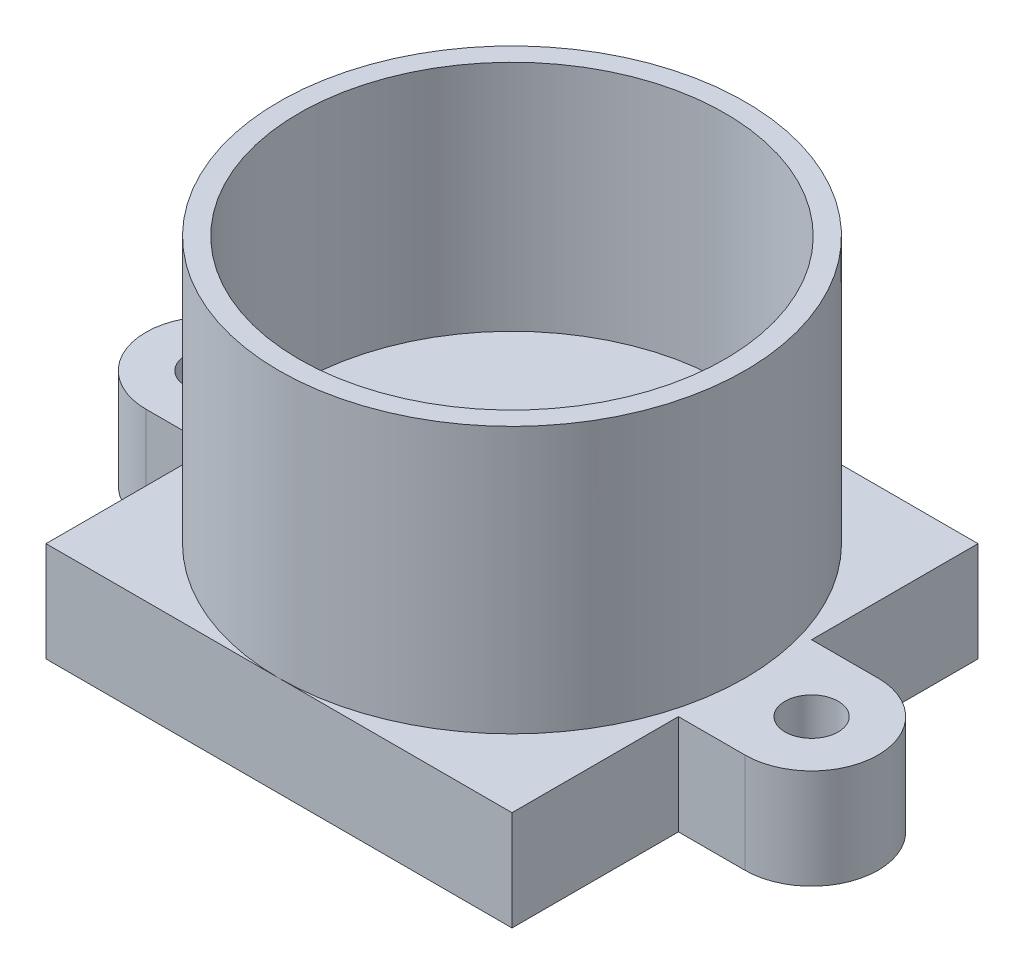
ISO-10303-21;
HEADER;
FILE_DESCRIPTION(('STEP AP214'),'2;1');
FILE_NAME('part.step','',(''),(''),'','','');
FILE_SCHEMA(('AUTOMOTIVE_DESIGN { 1 0 10303 214 1 1 1 1 }'));
ENDSEC;
DATA;
#1=APPLICATION_CONTEXT('core data for automotive mechanical design processes');
#2=APPLICATION_PROTOCOL_DEFINITION('international standard','automotive_design',2000,#1);
#3=PRODUCT_CONTEXT('',#1,'mechanical');
#4=PRODUCT('Part','Part','',(#3));
#5=PRODUCT_RELATED_PRODUCT_CATEGORY('part','',(#4));
#6=PRODUCT_DEFINITION_FORMATION('','',#4);
#7=PRODUCT_DEFINITION_CONTEXT('part definition',#1,'design');
#8=PRODUCT_DEFINITION('design','',#6,#7);
#9=PRODUCT_DEFINITION_SHAPE('','',#8);
#10=(LENGTH_UNIT() NAMED_UNIT(*) SI_UNIT(.MILLI.,.METRE.));
#11=(NAMED_UNIT(*) PLANE_ANGLE_UNIT() SI_UNIT($,.RADIAN.));
#12=(NAMED_UNIT(*) SI_UNIT($,.STERADIAN.) SOLID_ANGLE_UNIT());
#13=UNCERTAINTY_MEASURE_WITH_UNIT(LENGTH_MEASURE(1.E-05),#10,'distance_accuracy_value','');
#14=(GEOMETRIC_REPRESENTATION_CONTEXT(3) GLOBAL_UNCERTAINTY_ASSIGNED_CONTEXT((#13)) GLOBAL_UNIT_ASSIGNED_CONTEXT((#10,
#11,#12)) REPRESENTATION_CONTEXT('',''));
#15=CARTESIAN_POINT('',(0.,0.,0.));
#16=DIRECTION('',(0.,0.,1.));
#17=DIRECTION('',(1.,0.,0.));
#18=AXIS2_PLACEMENT_3D('',#15,#16,#17);
#19=CARTESIAN_POINT('',(0.,3.,0.));
#20=DIRECTION('',(0.,1.,0.));
#21=DIRECTION('',(0.,0.,1.));
#22=AXIS2_PLACEMENT_3D('',#19,#20,#21);
#23=PLANE('',#22);
#24=CARTESIAN_POINT('',(0.,3.,0.));
#25=DIRECTION('',(0.,1.,0.));
#26=DIRECTION('',(0.,0.,1.));
#27=AXIS2_PLACEMENT_3D('',#24,#25,#26);
#28=CIRCLE('',#27,7.);
#29=CARTESIAN_POINT('',(0.,3.,7.));
#30=VERTEX_POINT('',#29);
#31=CARTESIAN_POINT('',(0.,3.,-7.));
#32=VERTEX_POINT('',#31);
#33=EDGE_CURVE('E50',#30,#32,#28,.T.);
#34=ORIENTED_EDGE('',*,*,#33,.F.);
#35=DIRECTION('',(1.,0.,0.));
#36=VECTOR('',#35,1.);
#37=CARTESIAN_POINT('',(-6.99999999999999,3.,7.));
#38=LINE('',#37,#36);
#39=CARTESIAN_POINT('',(7.00000000000001,3.,7.));
#40=VERTEX_POINT('',#39);
#41=EDGE_CURVE('E146',#30,#40,#38,.T.);
#42=ORIENTED_EDGE('',*,*,#41,.T.);
#43=DIRECTION('',(0.,0.,-1.));
#44=VECTOR('',#43,1.);
#45=CARTESIAN_POINT('',(7.00000000000001,3.,-7.));
#46=LINE('',#45,#44);
#47=CARTESIAN_POINT('',(7.00000000000001,3.,2.));
#48=VERTEX_POINT('',#47);
#49=EDGE_CURVE('E272',#40,#48,#46,.T.);
#50=ORIENTED_EDGE('',*,*,#49,.T.);
#51=DIRECTION('',(1.,0.,0.));
#52=VECTOR('',#51,1.);
#53=CARTESIAN_POINT('',(7.00000000000001,3.,2.));
#54=LINE('',#53,#52);
#55=CARTESIAN_POINT('',(9.00000000000001,3.,2.));
#56=VERTEX_POINT('',#55);
#57=EDGE_CURVE('E63',#48,#56,#54,.T.);
#58=ORIENTED_EDGE('',*,*,#57,.T.);
#59=CARTESIAN_POINT('',(9.00000000000001,3.,0.));
#60=DIRECTION('',(0.,1.,0.));
#61=DIRECTION('',(0.,0.,-1.));
#62=AXIS2_PLACEMENT_3D('',#59,#60,#61);
#63=CIRCLE('',#62,2.);
#64=CARTESIAN_POINT('',(9.00000000000001,3.,-2.));
#65=VERTEX_POINT('',#64);
#66=EDGE_CURVE('E330',#56,#65,#63,.T.);
#67=ORIENTED_EDGE('',*,*,#66,.T.);
#68=DIRECTION('',(-1.,0.,0.));
#69=VECTOR('',#68,1.);
#70=CARTESIAN_POINT('',(7.00000000000001,3.,-2.));
#71=LINE('',#70,#69);
#72=CARTESIAN_POINT('',(7.00000000000001,3.,-2.));
#73=VERTEX_POINT('',#72);
#74=EDGE_CURVE('E312',#65,#73,#71,.T.);
#75=ORIENTED_EDGE('',*,*,#74,.T.);
#76=CARTESIAN_POINT('',(7.00000000000001,3.,-7.));
#77=VERTEX_POINT('',#76);
#78=EDGE_CURVE('E246',#73,#77,#46,.T.);
#79=ORIENTED_EDGE('',*,*,#78,.T.);
#80=DIRECTION('',(-1.,0.,0.));
#81=VECTOR('',#80,1.);
#82=CARTESIAN_POINT('',(-6.99999999999999,3.,-7.));
#83=LINE('',#82,#81);
#84=EDGE_CURVE('E161',#77,#32,#83,.T.);
#85=ORIENTED_EDGE('',*,*,#84,.T.);
#86=EDGE_LOOP('',(#34,#42,#50,#58,#67,#75,#79,#85));
#87=FACE_BOUND('',#86,.T.);
#88=CARTESIAN_POINT('',(9.,3.,0.));
#89=DIRECTION('',(0.,1.,0.));
#90=DIRECTION('',(0.,0.,1.));
#91=AXIS2_PLACEMENT_3D('',#88,#89,#90);
#92=CIRCLE('',#91,0.800000000000001);
#93=CARTESIAN_POINT('',(9.,3.,0.800000000000001));
#94=VERTEX_POINT('',#93);
#95=EDGE_CURVE('E337',#94,#94,#92,.T.);
#96=ORIENTED_EDGE('',*,*,#95,.F.);
#97=EDGE_LOOP('',(#96));
#98=FACE_BOUND('',#97,.T.);
#99=ADVANCED_FACE('F39',(#87,#98),#23,.T.);
#100=CARTESIAN_POINT('',(7.00000000000001,3.,-7.));
#101=DIRECTION('',(-1.,0.,0.));
#102=DIRECTION('',(0.,0.,1.));
#103=AXIS2_PLACEMENT_3D('',#100,#101,#102);
#104=PLANE('',#103);
#105=DIRECTION('',(0.,1.,0.));
#106=VECTOR('',#105,1.);
#107=CARTESIAN_POINT('',(7.00000000000001,0.,-2.));
#108=LINE('',#107,#106);
#109=CARTESIAN_POINT('',(7.00000000000001,0.,-2.));
#110=VERTEX_POINT('',#109);
#111=EDGE_CURVE('E295',#110,#73,#108,.T.);
#112=ORIENTED_EDGE('',*,*,#111,.F.);
#113=DIRECTION('',(0.,0.,-1.));
#114=VECTOR('',#113,1.);
#115=CARTESIAN_POINT('',(7.00000000000001,0.,-7.));
#116=LINE('',#115,#114);
#117=CARTESIAN_POINT('',(7.00000000000001,0.,-7.));
#118=VERTEX_POINT('',#117);
#119=EDGE_CURVE('E263',#110,#118,#116,.T.);
#120=ORIENTED_EDGE('',*,*,#119,.T.);
#121=DIRECTION('',(0.,-1.,0.));
#122=VECTOR('',#121,1.);
#123=CARTESIAN_POINT('',(7.00000000000001,3.,-7.));
#124=LINE('',#123,#122);
#125=EDGE_CURVE('E43',#77,#118,#124,.T.);
#126=ORIENTED_EDGE('',*,*,#125,.F.);
#127=ORIENTED_EDGE('',*,*,#78,.F.);
#128=EDGE_LOOP('',(#112,#120,#126,#127));
#129=FACE_BOUND('',#128,.T.);
#130=ADVANCED_FACE('F184',(#129),#104,.F.);
#131=CARTESIAN_POINT('',(-6.99999999999999,3.,-7.));
#132=DIRECTION('',(1.,0.,0.));
#133=DIRECTION('',(0.,0.,-1.));
#134=AXIS2_PLACEMENT_3D('',#131,#132,#133);
#135=PLANE('',#134);
#136=DIRECTION('',(0.,1.,0.));
#137=VECTOR('',#136,1.);
#138=CARTESIAN_POINT('',(-6.99999999999999,0.,2.));
#139=LINE('',#138,#137);
#140=CARTESIAN_POINT('',(-6.99999999999999,0.,2.));
#141=VERTEX_POINT('',#140);
#142=CARTESIAN_POINT('',(-6.99999999999999,3.,2.));
#143=VERTEX_POINT('',#142);
#144=EDGE_CURVE('E265',#141,#143,#139,.T.);
#145=ORIENTED_EDGE('',*,*,#144,.F.);
#146=DIRECTION('',(0.,0.,1.));
#147=VECTOR('',#146,1.);
#148=CARTESIAN_POINT('',(-6.99999999999999,0.,-7.));
#149=LINE('',#148,#147);
#150=CARTESIAN_POINT('',(-6.99999999999999,0.,7.));
#151=VERTEX_POINT('',#150);
#152=EDGE_CURVE('E227',#141,#151,#149,.T.);
#153=ORIENTED_EDGE('',*,*,#152,.T.);
#154=DIRECTION('',(0.,-1.,0.));
#155=VECTOR('',#154,1.);
#156=CARTESIAN_POINT('',(-6.99999999999999,3.,7.));
#157=LINE('',#156,#155);
#158=CARTESIAN_POINT('',(-6.99999999999999,3.,7.));
#159=VERTEX_POINT('',#158);
#160=EDGE_CURVE('E235',#159,#151,#157,.T.);
#161=ORIENTED_EDGE('',*,*,#160,.F.);
#162=DIRECTION('',(0.,0.,1.));
#163=VECTOR('',#162,1.);
#164=CARTESIAN_POINT('',(-6.99999999999999,3.,-7.));
#165=LINE('',#164,#163);
#166=EDGE_CURVE('E140',#143,#159,#165,.T.);
#167=ORIENTED_EDGE('',*,*,#166,.F.);
#168=EDGE_LOOP('',(#145,#153,#161,#167));
#169=FACE_BOUND('',#168,.T.);
#170=ADVANCED_FACE('F189',(#169),#135,.F.);
#171=CARTESIAN_POINT('',(7.00000000000001,0.,7.));
#172=VERTEX_POINT('',#171);
#173=CARTESIAN_POINT('',(7.00000000000001,0.,2.));
#174=VERTEX_POINT('',#173);
#175=EDGE_CURVE('E228',#172,#174,#116,.T.);
#176=ORIENTED_EDGE('',*,*,#175,.T.);
#177=DIRECTION('',(0.,1.,0.));
#178=VECTOR('',#177,1.);
#179=CARTESIAN_POINT('',(7.00000000000001,0.,2.));
#180=LINE('',#179,#178);
#181=EDGE_CURVE('E300',#174,#48,#180,.T.);
#182=ORIENTED_EDGE('',*,*,#181,.T.);
#183=ORIENTED_EDGE('',*,*,#49,.F.);
#184=DIRECTION('',(0.,-1.,0.));
#185=VECTOR('',#184,1.);
#186=CARTESIAN_POINT('',(7.00000000000001,3.,7.));
#187=LINE('',#186,#185);
#188=EDGE_CURVE('E145',#40,#172,#187,.T.);
#189=ORIENTED_EDGE('',*,*,#188,.T.);
#190=EDGE_LOOP('',(#176,#182,#183,#189));
#191=FACE_BOUND('',#190,.T.);
#192=ADVANCED_FACE('F41',(#191),#104,.F.);
#193=CARTESIAN_POINT('',(-6.99999999999999,3.,-7.));
#194=DIRECTION('',(0.,0.,1.));
#195=DIRECTION('',(1.,0.,0.));
#196=AXIS2_PLACEMENT_3D('',#193,#194,#195);
#197=PLANE('',#196);
#198=DIRECTION('',(-1.,0.,0.));
#199=VECTOR('',#198,1.);
#200=CARTESIAN_POINT('',(-6.99999999999999,0.,-7.));
#201=LINE('',#200,#199);
#202=CARTESIAN_POINT('',(-6.99999999999999,0.,-7.));
#203=VERTEX_POINT('',#202);
#204=EDGE_CURVE('E218',#118,#203,#201,.T.);
#205=ORIENTED_EDGE('',*,*,#204,.T.);
#206=DIRECTION('',(0.,-1.,0.));
#207=VECTOR('',#206,1.);
#208=CARTESIAN_POINT('',(-6.99999999999999,3.,-7.));
#209=LINE('',#208,#207);
#210=CARTESIAN_POINT('',(-6.99999999999999,3.,-7.));
#211=VERTEX_POINT('',#210);
#212=EDGE_CURVE('E220',#211,#203,#209,.T.);
#213=ORIENTED_EDGE('',*,*,#212,.F.);
#214=EDGE_CURVE('E271',#32,#211,#83,.T.);
#215=ORIENTED_EDGE('',*,*,#214,.F.);
#216=ORIENTED_EDGE('',*,*,#84,.F.);
#217=ORIENTED_EDGE('',*,*,#125,.T.);
#218=EDGE_LOOP('',(#205,#213,#215,#216,#217));
#219=FACE_BOUND('',#218,.T.);
#220=ADVANCED_FACE('F206',(#219),#197,.F.);
#221=CARTESIAN_POINT('',(-6.99999999999999,0.,-2.));
#222=VERTEX_POINT('',#221);
#223=EDGE_CURVE('E232',#203,#222,#149,.T.);
#224=ORIENTED_EDGE('',*,*,#223,.T.);
#225=DIRECTION('',(0.,1.,0.));
#226=VECTOR('',#225,1.);
#227=CARTESIAN_POINT('',(-6.99999999999999,0.,-2.));
#228=LINE('',#227,#226);
#229=CARTESIAN_POINT('',(-6.99999999999999,3.,-2.));
#230=VERTEX_POINT('',#229);
#231=EDGE_CURVE('E275',#222,#230,#228,.T.);
#232=ORIENTED_EDGE('',*,*,#231,.T.);
#233=EDGE_CURVE('E156',#211,#230,#165,.T.);
#234=ORIENTED_EDGE('',*,*,#233,.F.);
#235=ORIENTED_EDGE('',*,*,#212,.T.);
#236=EDGE_LOOP('',(#224,#232,#234,#235));
#237=FACE_BOUND('',#236,.T.);
#238=ADVANCED_FACE('F201',(#237),#135,.F.);
#239=CARTESIAN_POINT('',(-6.99999999999999,3.,7.));
#240=DIRECTION('',(0.,0.,-1.));
#241=DIRECTION('',(-1.,0.,0.));
#242=AXIS2_PLACEMENT_3D('',#239,#240,#241);
#243=PLANE('',#242);
#244=DIRECTION('',(1.,0.,0.));
#245=VECTOR('',#244,1.);
#246=CARTESIAN_POINT('',(-6.99999999999999,0.,7.));
#247=LINE('',#246,#245);
#248=EDGE_CURVE('E242',#151,#172,#247,.T.);
#249=ORIENTED_EDGE('',*,*,#248,.T.);
#250=ORIENTED_EDGE('',*,*,#188,.F.);
#251=ORIENTED_EDGE('',*,*,#41,.F.);
#252=EDGE_CURVE('E134',#159,#30,#38,.T.);
#253=ORIENTED_EDGE('',*,*,#252,.F.);
#254=ORIENTED_EDGE('',*,*,#160,.T.);
#255=EDGE_LOOP('',(#249,#250,#251,#253,#254));
#256=FACE_BOUND('',#255,.T.);
#257=ADVANCED_FACE('F150',(#256),#243,.F.);
#258=EDGE_CURVE('E11',#32,#30,#28,.T.);
#259=ORIENTED_EDGE('',*,*,#258,.F.);
#260=ORIENTED_EDGE('',*,*,#214,.T.);
#261=ORIENTED_EDGE('',*,*,#233,.T.);
#262=DIRECTION('',(-1.,0.,0.));
#263=VECTOR('',#262,1.);
#264=CARTESIAN_POINT('',(-6.99999999999999,3.,-2.));
#265=LINE('',#264,#263);
#266=CARTESIAN_POINT('',(-8.99999999999999,3.,-2.));
#267=VERTEX_POINT('',#266);
#268=EDGE_CURVE('E291',#230,#267,#265,.T.);
#269=ORIENTED_EDGE('',*,*,#268,.T.);
#270=CARTESIAN_POINT('',(-8.99999999999999,3.,0.));
#271=DIRECTION('',(0.,1.,0.));
#272=DIRECTION('',(0.,0.,-1.));
#273=AXIS2_PLACEMENT_3D('',#270,#271,#272);
#274=CIRCLE('',#273,2.);
#275=CARTESIAN_POINT('',(-8.99999999999999,3.,2.));
#276=VERTEX_POINT('',#275);
#277=EDGE_CURVE('E323',#267,#276,#274,.T.);
#278=ORIENTED_EDGE('',*,*,#277,.T.);
#279=DIRECTION('',(1.,0.,0.));
#280=VECTOR('',#279,1.);
#281=CARTESIAN_POINT('',(-6.99999999999999,3.,2.));
#282=LINE('',#281,#280);
#283=EDGE_CURVE('E288',#276,#143,#282,.T.);
#284=ORIENTED_EDGE('',*,*,#283,.T.);
#285=ORIENTED_EDGE('',*,*,#166,.T.);
#286=ORIENTED_EDGE('',*,*,#252,.T.);
#287=EDGE_LOOP('',(#259,#260,#261,#269,#278,#284,#285,#286));
#288=FACE_BOUND('',#287,.T.);
#289=CARTESIAN_POINT('',(-9.,3.,0.));
#290=DIRECTION('',(0.,1.,0.));
#291=DIRECTION('',(0.,0.,1.));
#292=AXIS2_PLACEMENT_3D('',#289,#290,#291);
#293=CIRCLE('',#292,0.800000000000001);
#294=CARTESIAN_POINT('',(-9.,3.,0.800000000000002));
#295=VERTEX_POINT('',#294);
#296=EDGE_CURVE('E345',#295,#295,#293,.T.);
#297=ORIENTED_EDGE('',*,*,#296,.F.);
#298=EDGE_LOOP('',(#297));
#299=FACE_BOUND('',#298,.T.);
#300=ADVANCED_FACE('F136',(#288,#299),#23,.T.);
#301=CARTESIAN_POINT('',(0.,0.,0.));
#302=DIRECTION('',(0.,1.,0.));
#303=DIRECTION('',(0.,0.,1.));
#304=AXIS2_PLACEMENT_3D('',#301,#302,#303);
#305=PLANE('',#304);
#306=CARTESIAN_POINT('',(-9.,0.,0.));
#307=DIRECTION('',(0.,1.,0.));
#308=DIRECTION('',(0.,0.,1.));
#309=AXIS2_PLACEMENT_3D('',#306,#307,#308);
#310=CIRCLE('',#309,0.800000000000001);
#311=CARTESIAN_POINT('',(-9.,0.,0.800000000000002));
#312=VERTEX_POINT('',#311);
#313=EDGE_CURVE('E334',#312,#312,#310,.T.);
#314=ORIENTED_EDGE('',*,*,#313,.T.);
#315=EDGE_LOOP('',(#314));
#316=FACE_BOUND('',#315,.T.);
#317=CARTESIAN_POINT('',(9.,0.,0.));
#318=DIRECTION('',(0.,1.,0.));
#319=DIRECTION('',(0.,0.,1.));
#320=AXIS2_PLACEMENT_3D('',#317,#318,#319);
#321=CIRCLE('',#320,0.800000000000001);
#322=CARTESIAN_POINT('',(9.,0.,0.800000000000001));
#323=VERTEX_POINT('',#322);
#324=EDGE_CURVE('E341',#323,#323,#321,.T.);
#325=ORIENTED_EDGE('',*,*,#324,.T.);
#326=EDGE_LOOP('',(#325));
#327=FACE_BOUND('',#326,.T.);
#328=ORIENTED_EDGE('',*,*,#175,.F.);
#329=ORIENTED_EDGE('',*,*,#248,.F.);
#330=ORIENTED_EDGE('',*,*,#152,.F.);
#331=DIRECTION('',(1.,0.,0.));
#332=VECTOR('',#331,1.);
#333=CARTESIAN_POINT('',(-6.99999999999999,0.,2.));
#334=LINE('',#333,#332);
#335=CARTESIAN_POINT('',(-8.99999999999999,0.,2.));
#336=VERTEX_POINT('',#335);
#337=EDGE_CURVE('E279',#336,#141,#334,.T.);
#338=ORIENTED_EDGE('',*,*,#337,.F.);
#339=CARTESIAN_POINT('',(-8.99999999999999,0.,0.));
#340=DIRECTION('',(0.,1.,0.));
#341=DIRECTION('',(0.,0.,-1.));
#342=AXIS2_PLACEMENT_3D('',#339,#340,#341);
#343=CIRCLE('',#342,2.);
#344=CARTESIAN_POINT('',(-8.99999999999999,0.,-2.));
#345=VERTEX_POINT('',#344);
#346=EDGE_CURVE('E318',#345,#336,#343,.T.);
#347=ORIENTED_EDGE('',*,*,#346,.F.);
#348=DIRECTION('',(-1.,0.,0.));
#349=VECTOR('',#348,1.);
#350=CARTESIAN_POINT('',(-6.99999999999999,0.,-2.));
#351=LINE('',#350,#349);
#352=EDGE_CURVE('E240',#222,#345,#351,.T.);
#353=ORIENTED_EDGE('',*,*,#352,.F.);
#354=ORIENTED_EDGE('',*,*,#223,.F.);
#355=ORIENTED_EDGE('',*,*,#204,.F.);
#356=ORIENTED_EDGE('',*,*,#119,.F.);
#357=DIRECTION('',(-1.,0.,0.));
#358=VECTOR('',#357,1.);
#359=CARTESIAN_POINT('',(7.00000000000001,0.,-2.));
#360=LINE('',#359,#358);
#361=CARTESIAN_POINT('',(9.00000000000001,0.,-2.));
#362=VERTEX_POINT('',#361);
#363=EDGE_CURVE('E304',#362,#110,#360,.T.);
#364=ORIENTED_EDGE('',*,*,#363,.F.);
#365=CARTESIAN_POINT('',(9.00000000000001,0.,0.));
#366=DIRECTION('',(0.,1.,0.));
#367=DIRECTION('',(0.,0.,-1.));
#368=AXIS2_PLACEMENT_3D('',#365,#366,#367);
#369=CIRCLE('',#368,2.);
#370=CARTESIAN_POINT('',(9.00000000000001,0.,2.));
#371=VERTEX_POINT('',#370);
#372=EDGE_CURVE('E327',#371,#362,#369,.T.);
#373=ORIENTED_EDGE('',*,*,#372,.F.);
#374=DIRECTION('',(1.,0.,0.));
#375=VECTOR('',#374,1.);
#376=CARTESIAN_POINT('',(7.00000000000001,0.,2.));
#377=LINE('',#376,#375);
#378=EDGE_CURVE('E261',#174,#371,#377,.T.);
#379=ORIENTED_EDGE('',*,*,#378,.F.);
#380=EDGE_LOOP('',(#328,#329,#330,#338,#347,#353,#354,#355,#356,#364,#373,#379));
#381=FACE_BOUND('',#380,.T.);
#382=ADVANCED_FACE('F194',(#316,#327,#381),#305,.F.);
#383=CARTESIAN_POINT('',(-6.99999999999999,0.,2.));
#384=DIRECTION('',(0.,0.,1.));
#385=DIRECTION('',(1.,0.,0.));
#386=AXIS2_PLACEMENT_3D('',#383,#384,#385);
#387=PLANE('',#386);
#388=ORIENTED_EDGE('',*,*,#283,.F.);
#389=DIRECTION('',(0.,1.,0.));
#390=VECTOR('',#389,1.);
#391=CARTESIAN_POINT('',(-8.99999999999999,0.,2.));
#392=LINE('',#391,#390);
#393=EDGE_CURVE('E283',#336,#276,#392,.T.);
#394=ORIENTED_EDGE('',*,*,#393,.F.);
#395=ORIENTED_EDGE('',*,*,#337,.T.);
#396=ORIENTED_EDGE('',*,*,#144,.T.);
#397=EDGE_LOOP('',(#388,#394,#395,#396));
#398=FACE_BOUND('',#397,.T.);
#399=ADVANCED_FACE('F199',(#398),#387,.T.);
#400=CARTESIAN_POINT('',(-6.99999999999999,0.,-2.));
#401=DIRECTION('',(0.,0.,-1.));
#402=DIRECTION('',(-1.,0.,0.));
#403=AXIS2_PLACEMENT_3D('',#400,#401,#402);
#404=PLANE('',#403);
#405=ORIENTED_EDGE('',*,*,#268,.F.);
#406=ORIENTED_EDGE('',*,*,#231,.F.);
#407=ORIENTED_EDGE('',*,*,#352,.T.);
#408=DIRECTION('',(0.,1.,0.));
#409=VECTOR('',#408,1.);
#410=CARTESIAN_POINT('',(-8.99999999999999,0.,-2.));
#411=LINE('',#410,#409);
#412=EDGE_CURVE('E278',#345,#267,#411,.T.);
#413=ORIENTED_EDGE('',*,*,#412,.T.);
#414=EDGE_LOOP('',(#405,#406,#407,#413));
#415=FACE_BOUND('',#414,.T.);
#416=ADVANCED_FACE('F474',(#415),#404,.T.);
#417=CARTESIAN_POINT('',(7.00000000000001,0.,-2.));
#418=DIRECTION('',(0.,0.,-1.));
#419=DIRECTION('',(-1.,0.,0.));
#420=AXIS2_PLACEMENT_3D('',#417,#418,#419);
#421=PLANE('',#420);
#422=ORIENTED_EDGE('',*,*,#74,.F.);
#423=DIRECTION('',(0.,1.,0.));
#424=VECTOR('',#423,1.);
#425=CARTESIAN_POINT('',(9.00000000000001,0.,-2.));
#426=LINE('',#425,#424);
#427=EDGE_CURVE('E307',#362,#65,#426,.T.);
#428=ORIENTED_EDGE('',*,*,#427,.F.);
#429=ORIENTED_EDGE('',*,*,#363,.T.);
#430=ORIENTED_EDGE('',*,*,#111,.T.);
#431=EDGE_LOOP('',(#422,#428,#429,#430));
#432=FACE_BOUND('',#431,.T.);
#433=ADVANCED_FACE('F465',(#432),#421,.T.);
#434=CARTESIAN_POINT('',(7.00000000000001,0.,2.));
#435=DIRECTION('',(0.,0.,1.));
#436=DIRECTION('',(1.,0.,0.));
#437=AXIS2_PLACEMENT_3D('',#434,#435,#436);
#438=PLANE('',#437);
#439=ORIENTED_EDGE('',*,*,#57,.F.);
#440=ORIENTED_EDGE('',*,*,#181,.F.);
#441=ORIENTED_EDGE('',*,*,#378,.T.);
#442=DIRECTION('',(0.,1.,0.));
#443=VECTOR('',#442,1.);
#444=CARTESIAN_POINT('',(9.00000000000001,0.,2.));
#445=LINE('',#444,#443);
#446=EDGE_CURVE('E303',#371,#56,#445,.T.);
#447=ORIENTED_EDGE('',*,*,#446,.T.);
#448=EDGE_LOOP('',(#439,#440,#441,#447));
#449=FACE_BOUND('',#448,.T.);
#450=ADVANCED_FACE('F455',(#449),#438,.T.);
#451=CARTESIAN_POINT('',(-8.99999999999999,0.,0.));
#452=DIRECTION('',(0.,1.,0.));
#453=DIRECTION('',(0.,0.,1.));
#454=AXIS2_PLACEMENT_3D('',#451,#452,#453);
#455=CYLINDRICAL_SURFACE('',#454,2.);
#456=ORIENTED_EDGE('',*,*,#277,.F.);
#457=ORIENTED_EDGE('',*,*,#412,.F.);
#458=ORIENTED_EDGE('',*,*,#346,.T.);
#459=ORIENTED_EDGE('',*,*,#393,.T.);
#460=EDGE_LOOP('',(#456,#457,#458,#459));
#461=FACE_BOUND('',#460,.T.);
#462=ADVANCED_FACE('F446',(#461),#455,.T.);
#463=CARTESIAN_POINT('',(9.00000000000001,0.,0.));
#464=DIRECTION('',(0.,1.,0.));
#465=DIRECTION('',(0.,0.,1.));
#466=AXIS2_PLACEMENT_3D('',#463,#464,#465);
#467=CYLINDRICAL_SURFACE('',#466,2.);
#468=ORIENTED_EDGE('',*,*,#66,.F.);
#469=ORIENTED_EDGE('',*,*,#446,.F.);
#470=ORIENTED_EDGE('',*,*,#372,.T.);
#471=ORIENTED_EDGE('',*,*,#427,.T.);
#472=EDGE_LOOP('',(#468,#469,#470,#471));
#473=FACE_BOUND('',#472,.T.);
#474=ADVANCED_FACE('F428',(#473),#467,.T.);
#475=CARTESIAN_POINT('',(9.,0.,0.));
#476=DIRECTION('',(0.,1.,0.));
#477=DIRECTION('',(0.,0.,1.));
#478=AXIS2_PLACEMENT_3D('',#475,#476,#477);
#479=CYLINDRICAL_SURFACE('',#478,0.800000000000001);
#480=ORIENTED_EDGE('',*,*,#324,.F.);
#481=EDGE_LOOP('',(#480));
#482=FACE_BOUND('',#481,.T.);
#483=ORIENTED_EDGE('',*,*,#95,.T.);
#484=EDGE_LOOP('',(#483));
#485=FACE_BOUND('',#484,.T.);
#486=ADVANCED_FACE('F179',(#482,#485),#479,.F.);
#487=CARTESIAN_POINT('',(-9.,0.,0.));
#488=DIRECTION('',(0.,1.,0.));
#489=DIRECTION('',(0.,0.,1.));
#490=AXIS2_PLACEMENT_3D('',#487,#488,#489);
#491=CYLINDRICAL_SURFACE('',#490,0.800000000000001);
#492=ORIENTED_EDGE('',*,*,#313,.F.);
#493=EDGE_LOOP('',(#492));
#494=FACE_BOUND('',#493,.T.);
#495=ORIENTED_EDGE('',*,*,#296,.T.);
#496=EDGE_LOOP('',(#495));
#497=FACE_BOUND('',#496,.T.);
#498=ADVANCED_FACE('F169',(#494,#497),#491,.F.);
#499=CARTESIAN_POINT('',(0.,11.,0.));
#500=DIRECTION('',(0.,-1.,0.));
#501=DIRECTION('',(0.,0.,-1.));
#502=AXIS2_PLACEMENT_3D('',#499,#500,#501);
#503=CYLINDRICAL_SURFACE('',#502,7.);
#504=CARTESIAN_POINT('',(0.,11.,0.));
#505=DIRECTION('',(0.,1.,0.));
#506=DIRECTION('',(0.,0.,1.));
#507=AXIS2_PLACEMENT_3D('',#504,#505,#506);
#508=CIRCLE('',#507,7.);
#509=CARTESIAN_POINT('',(0.,11.,7.));
#510=VERTEX_POINT('',#509);
#511=EDGE_CURVE('E164',#510,#510,#508,.T.);
#512=ORIENTED_EDGE('',*,*,#511,.F.);
#513=EDGE_LOOP('',(#512));
#514=FACE_BOUND('',#513,.T.);
#515=ORIENTED_EDGE('',*,*,#33,.T.);
#516=ORIENTED_EDGE('',*,*,#258,.T.);
#517=EDGE_LOOP('',(#515,#516));
#518=FACE_BOUND('',#517,.T.);
#519=ADVANCED_FACE('F166',(#514,#518),#503,.T.);
#520=CARTESIAN_POINT('',(0.,11.,0.));
#521=DIRECTION('',(0.,1.,0.));
#522=DIRECTION('',(0.,0.,1.));
#523=AXIS2_PLACEMENT_3D('',#520,#521,#522);
#524=PLANE('',#523);
#525=CARTESIAN_POINT('',(0.,11.,0.));
#526=DIRECTION('',(0.,1.,0.));
#527=DIRECTION('',(0.,0.,1.));
#528=AXIS2_PLACEMENT_3D('',#525,#526,#527);
#529=CIRCLE('',#528,6.4);
#530=CARTESIAN_POINT('',(0.,11.,6.4));
#531=VERTEX_POINT('',#530);
#532=EDGE_CURVE('E355',#531,#531,#529,.T.);
#533=ORIENTED_EDGE('',*,*,#532,.F.);
#534=EDGE_LOOP('',(#533));
#535=FACE_BOUND('',#534,.T.);
#536=ORIENTED_EDGE('',*,*,#511,.T.);
#537=EDGE_LOOP('',(#536));
#538=FACE_BOUND('',#537,.T.);
#539=ADVANCED_FACE('F168',(#535,#538),#524,.T.);
#540=CARTESIAN_POINT('',(0.,4.,0.));
#541=DIRECTION('',(0.,1.,0.));
#542=DIRECTION('',(0.,0.,1.));
#543=AXIS2_PLACEMENT_3D('',#540,#541,#542);
#544=CYLINDRICAL_SURFACE('',#543,6.4);
#545=CARTESIAN_POINT('',(0.,4.,0.));
#546=DIRECTION('',(0.,1.,0.));
#547=DIRECTION('',(0.,0.,1.));
#548=AXIS2_PLACEMENT_3D('',#545,#546,#547);
#549=CIRCLE('',#548,6.4);
#550=CARTESIAN_POINT('',(0.,4.,6.4));
#551=VERTEX_POINT('',#550);
#552=EDGE_CURVE('E165',#551,#551,#549,.T.);
#553=ORIENTED_EDGE('',*,*,#552,.F.);
#554=EDGE_LOOP('',(#553));
#555=FACE_BOUND('',#554,.T.);
#556=ORIENTED_EDGE('',*,*,#532,.T.);
#557=EDGE_LOOP('',(#556));
#558=FACE_BOUND('',#557,.T.);
#559=ADVANCED_FACE('F176',(#555,#558),#544,.F.);
#560=CARTESIAN_POINT('',(0.,4.,0.));
#561=DIRECTION('',(0.,1.,0.));
#562=DIRECTION('',(0.,0.,1.));
#563=AXIS2_PLACEMENT_3D('',#560,#561,#562);
#564=PLANE('',#563);
#565=ORIENTED_EDGE('',*,*,#552,.T.);
#566=EDGE_LOOP('',(#565));
#567=FACE_BOUND('',#566,.T.);
#568=ADVANCED_FACE('F363',(#567),#564,.T.);
#569=CLOSED_SHELL('',(#99,#130,#170,#192,#220,#238,#257,#300,#382,#399,#416,#433,#450,#462,#474,
#486,#498,#519,#539,#559,#568));
#570=MANIFOLD_SOLID_BREP('B2',#569);
#571=ADVANCED_BREP_SHAPE_REPRESENTATION('',(#18,#570),#14);
#572=SHAPE_DEFINITION_REPRESENTATION(#9,#571);
ENDSEC;
END-ISO-10303-21;
